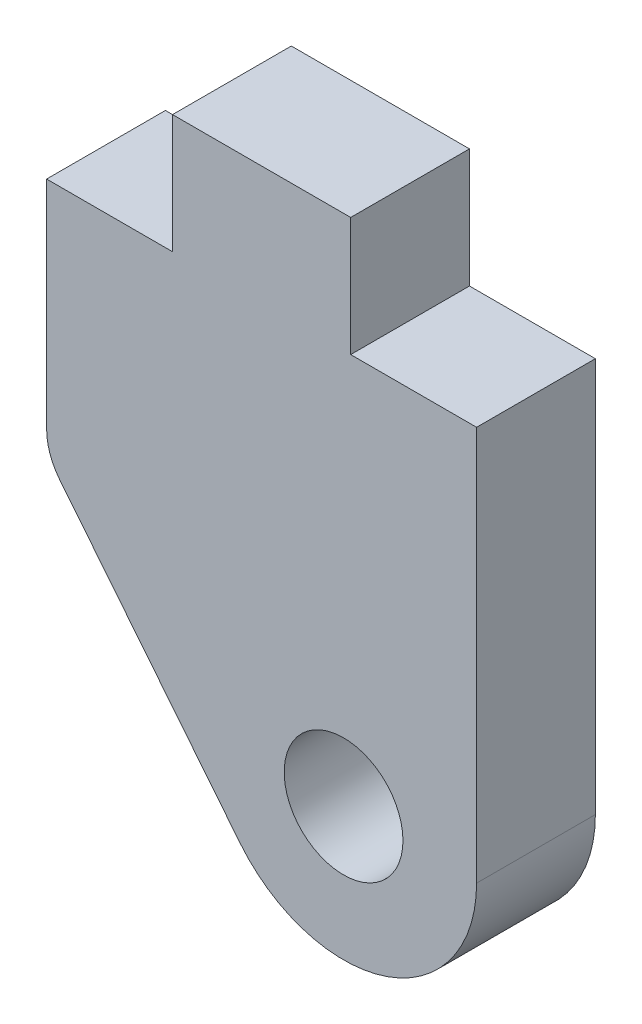
ISO-10303-21;
HEADER;
FILE_DESCRIPTION(('STEP AP214'),'2;1');
FILE_NAME('part.step','',(''),(''),'','','');
FILE_SCHEMA(('AUTOMOTIVE_DESIGN { 1 0 10303 214 1 1 1 1 }'));
ENDSEC;
DATA;
#1=APPLICATION_CONTEXT('core data for automotive mechanical design processes');
#2=APPLICATION_PROTOCOL_DEFINITION('international standard','automotive_design',2000,#1);
#3=PRODUCT_CONTEXT('',#1,'mechanical');
#4=PRODUCT('Part','Part','',(#3));
#5=PRODUCT_RELATED_PRODUCT_CATEGORY('part','',(#4));
#6=PRODUCT_DEFINITION_FORMATION('','',#4);
#7=PRODUCT_DEFINITION_CONTEXT('part definition',#1,'design');
#8=PRODUCT_DEFINITION('design','',#6,#7);
#9=PRODUCT_DEFINITION_SHAPE('','',#8);
#10=(LENGTH_UNIT() NAMED_UNIT(*) SI_UNIT(.MILLI.,.METRE.));
#11=(NAMED_UNIT(*) PLANE_ANGLE_UNIT() SI_UNIT($,.RADIAN.));
#12=(NAMED_UNIT(*) SI_UNIT($,.STERADIAN.) SOLID_ANGLE_UNIT());
#13=UNCERTAINTY_MEASURE_WITH_UNIT(LENGTH_MEASURE(1.E-05),#10,'distance_accuracy_value','');
#14=(GEOMETRIC_REPRESENTATION_CONTEXT(3) GLOBAL_UNCERTAINTY_ASSIGNED_CONTEXT((#13)) GLOBAL_UNIT_ASSIGNED_CONTEXT((#10,
#11,#12)) REPRESENTATION_CONTEXT('',''));
#15=CARTESIAN_POINT('',(0.,0.,0.));
#16=DIRECTION('',(0.,0.,1.));
#17=DIRECTION('',(1.,0.,0.));
#18=AXIS2_PLACEMENT_3D('',#15,#16,#17);
#19=CARTESIAN_POINT('',(-4.15925,-5.79139201383892,1.5875));
#20=DIRECTION('',(0.,0.,-1.));
#21=DIRECTION('',(-1.,0.,0.));
#22=AXIS2_PLACEMENT_3D('',#19,#20,#21);
#23=CYLINDRICAL_SURFACE('',#22,1.5875);
#24=CARTESIAN_POINT('',(-4.15925,-5.79139201383892,-1.5875));
#25=DIRECTION('',(0.,0.,1.));
#26=DIRECTION('',(1.,0.,0.));
#27=AXIS2_PLACEMENT_3D('',#24,#25,#26);
#28=CIRCLE('',#27,1.5875);
#29=CARTESIAN_POINT('',(-5.39693838550955,-6.78551660883431,-1.5875));
#30=VERTEX_POINT('',#29);
#31=CARTESIAN_POINT('',(-5.74675,-5.79139201383891,-1.5875));
#32=VERTEX_POINT('',#31);
#33=EDGE_CURVE('E156',#30,#32,#28,.F.);
#34=ORIENTED_EDGE('',*,*,#33,.F.);
#35=DIRECTION('',(0.,0.,-1.));
#36=VECTOR('',#35,1.);
#37=CARTESIAN_POINT('',(-5.39693838550955,-6.78551660883431,1.5875));
#38=LINE('',#37,#36);
#39=CARTESIAN_POINT('',(-5.39693838550955,-6.78551660883431,1.5875));
#40=VERTEX_POINT('',#39);
#41=EDGE_CURVE('E11',#40,#30,#38,.T.);
#42=ORIENTED_EDGE('',*,*,#41,.F.);
#43=CARTESIAN_POINT('',(-4.15925,-5.79139201383892,1.5875));
#44=DIRECTION('',(0.,0.,1.));
#45=DIRECTION('',(1.,0.,0.));
#46=AXIS2_PLACEMENT_3D('',#43,#44,#45);
#47=CIRCLE('',#46,1.5875);
#48=CARTESIAN_POINT('',(-5.74675,-5.79139201383891,1.5875));
#49=VERTEX_POINT('',#48);
#50=EDGE_CURVE('E196',#40,#49,#47,.F.);
#51=ORIENTED_EDGE('',*,*,#50,.T.);
#52=DIRECTION('',(0.,0.,-1.));
#53=VECTOR('',#52,1.);
#54=CARTESIAN_POINT('',(-5.74675,-5.79139201383891,1.5875));
#55=LINE('',#54,#53);
#56=EDGE_CURVE('E98',#49,#32,#55,.T.);
#57=ORIENTED_EDGE('',*,*,#56,.T.);
#58=EDGE_LOOP('',(#34,#42,#51,#57));
#59=FACE_BOUND('',#58,.T.);
#60=ADVANCED_FACE('F41',(#59),#23,.T.);
#61=CARTESIAN_POINT('',(-6.59341382887821,-5.29590075257269,1.5875));
#62=DIRECTION('',(0.779646227092635,0.626220217319929,0.));
#63=DIRECTION('',(-0.626220217319929,0.779646227092635,0.));
#64=AXIS2_PLACEMENT_3D('',#61,#62,#63);
#65=PLANE('',#64);
#66=DIRECTION('',(0.626220217319929,-0.779646227092635,0.));
#67=VECTOR('',#66,1.);
#68=CARTESIAN_POINT('',(-6.59341382887821,-5.29590075257269,-1.5875));
#69=LINE('',#68,#67);
#70=CARTESIAN_POINT('',(-0.581671983541413,-12.7805390927897,-1.5875));
#71=VERTEX_POINT('',#70);
#72=EDGE_CURVE('E160',#30,#71,#69,.T.);
#73=ORIENTED_EDGE('',*,*,#72,.T.);
#74=DIRECTION('',(0.,0.,-1.));
#75=VECTOR('',#74,1.);
#76=CARTESIAN_POINT('',(-0.581671983541413,-12.7805390927897,1.5875));
#77=LINE('',#76,#75);
#78=CARTESIAN_POINT('',(-0.581671983541413,-12.7805390927897,1.5875));
#79=VERTEX_POINT('',#78);
#80=EDGE_CURVE('E50',#79,#71,#77,.T.);
#81=ORIENTED_EDGE('',*,*,#80,.F.);
#82=DIRECTION('',(0.626220217319929,-0.779646227092635,0.));
#83=VECTOR('',#82,1.);
#84=CARTESIAN_POINT('',(-6.59341382887821,-5.29590075257269,1.5875));
#85=LINE('',#84,#83);
#86=EDGE_CURVE('E238',#40,#79,#85,.T.);
#87=ORIENTED_EDGE('',*,*,#86,.F.);
#88=ORIENTED_EDGE('',*,*,#41,.T.);
#89=EDGE_LOOP('',(#73,#81,#87,#88));
#90=FACE_BOUND('',#89,.T.);
#91=ADVANCED_FACE('F224',(#90),#65,.F.);
#92=CARTESIAN_POINT('',(2.19075,-10.5537,1.5875));
#93=DIRECTION('',(0.,0.,-1.));
#94=DIRECTION('',(-1.,0.,0.));
#95=AXIS2_PLACEMENT_3D('',#92,#93,#94);
#96=CYLINDRICAL_SURFACE('',#95,3.556);
#97=CARTESIAN_POINT('',(2.19075,-10.5537,-1.5875));
#98=DIRECTION('',(0.,0.,1.));
#99=DIRECTION('',(1.,0.,0.));
#100=AXIS2_PLACEMENT_3D('',#97,#98,#99);
#101=CIRCLE('',#100,3.556);
#102=CARTESIAN_POINT('',(5.74675,-10.5537,-1.5875));
#103=VERTEX_POINT('',#102);
#104=EDGE_CURVE('E164',#103,#71,#101,.F.);
#105=ORIENTED_EDGE('',*,*,#104,.F.);
#106=DIRECTION('',(0.,0.,-1.));
#107=VECTOR('',#106,1.);
#108=CARTESIAN_POINT('',(5.74675,-10.5537,1.5875));
#109=LINE('',#108,#107);
#110=CARTESIAN_POINT('',(5.74675,-10.5537,1.5875));
#111=VERTEX_POINT('',#110);
#112=EDGE_CURVE('E212',#111,#103,#109,.T.);
#113=ORIENTED_EDGE('',*,*,#112,.F.);
#114=CARTESIAN_POINT('',(2.19075,-10.5537,1.5875));
#115=DIRECTION('',(0.,0.,1.));
#116=DIRECTION('',(1.,0.,0.));
#117=AXIS2_PLACEMENT_3D('',#114,#115,#116);
#118=CIRCLE('',#117,3.556);
#119=EDGE_CURVE('E221',#111,#79,#118,.F.);
#120=ORIENTED_EDGE('',*,*,#119,.T.);
#121=ORIENTED_EDGE('',*,*,#80,.T.);
#122=EDGE_LOOP('',(#105,#113,#120,#121));
#123=FACE_BOUND('',#122,.T.);
#124=ADVANCED_FACE('F219',(#123),#96,.T.);
#125=CARTESIAN_POINT('',(5.74675,0.,1.5875));
#126=DIRECTION('',(1.,0.,0.));
#127=DIRECTION('',(0.,1.,0.));
#128=AXIS2_PLACEMENT_3D('',#125,#126,#127);
#129=PLANE('',#128);
#130=DIRECTION('',(0.,-1.,0.));
#131=VECTOR('',#130,1.);
#132=CARTESIAN_POINT('',(5.74675,0.,-1.5875));
#133=LINE('',#132,#131);
#134=CARTESIAN_POINT('',(5.74675,0.,-1.5875));
#135=VERTEX_POINT('',#134);
#136=EDGE_CURVE('E168',#135,#103,#133,.T.);
#137=ORIENTED_EDGE('',*,*,#136,.F.);
#138=DIRECTION('',(0.,0.,-1.));
#139=VECTOR('',#138,1.);
#140=CARTESIAN_POINT('',(5.74675,0.,1.5875));
#141=LINE('',#140,#139);
#142=CARTESIAN_POINT('',(5.74675,0.,1.5875));
#143=VERTEX_POINT('',#142);
#144=EDGE_CURVE('E209',#143,#135,#141,.T.);
#145=ORIENTED_EDGE('',*,*,#144,.F.);
#146=DIRECTION('',(0.,-1.,0.));
#147=VECTOR('',#146,1.);
#148=CARTESIAN_POINT('',(5.74675,0.,1.5875));
#149=LINE('',#148,#147);
#150=EDGE_CURVE('E235',#143,#111,#149,.T.);
#151=ORIENTED_EDGE('',*,*,#150,.T.);
#152=ORIENTED_EDGE('',*,*,#112,.T.);
#153=EDGE_LOOP('',(#137,#145,#151,#152));
#154=FACE_BOUND('',#153,.T.);
#155=ADVANCED_FACE('F232',(#154),#129,.T.);
#156=CARTESIAN_POINT('',(0.,0.,1.5875));
#157=DIRECTION('',(0.,1.,0.));
#158=DIRECTION('',(0.,0.,1.));
#159=AXIS2_PLACEMENT_3D('',#156,#157,#158);
#160=PLANE('',#159);
#161=DIRECTION('',(1.,0.,0.));
#162=VECTOR('',#161,1.);
#163=CARTESIAN_POINT('',(0.,0.,-1.5875));
#164=LINE('',#163,#162);
#165=CARTESIAN_POINT('',(2.38125,0.,-1.5875));
#166=VERTEX_POINT('',#165);
#167=EDGE_CURVE('E172',#166,#135,#164,.T.);
#168=ORIENTED_EDGE('',*,*,#167,.F.);
#169=DIRECTION('',(0.,0.,-1.));
#170=VECTOR('',#169,1.);
#171=CARTESIAN_POINT('',(2.38125,0.,1.5875));
#172=LINE('',#171,#170);
#173=CARTESIAN_POINT('',(2.38125,0.,1.5875));
#174=VERTEX_POINT('',#173);
#175=EDGE_CURVE('E206',#174,#166,#172,.T.);
#176=ORIENTED_EDGE('',*,*,#175,.F.);
#177=DIRECTION('',(1.,0.,0.));
#178=VECTOR('',#177,1.);
#179=CARTESIAN_POINT('',(0.,0.,1.5875));
#180=LINE('',#179,#178);
#181=EDGE_CURVE('E243',#174,#143,#180,.T.);
#182=ORIENTED_EDGE('',*,*,#181,.T.);
#183=ORIENTED_EDGE('',*,*,#144,.T.);
#184=EDGE_LOOP('',(#168,#176,#182,#183));
#185=FACE_BOUND('',#184,.T.);
#186=ADVANCED_FACE('F270',(#185),#160,.T.);
#187=CARTESIAN_POINT('',(2.38125,0.,1.5875));
#188=DIRECTION('',(-1.,0.,0.));
#189=DIRECTION('',(0.,0.,1.));
#190=AXIS2_PLACEMENT_3D('',#187,#188,#189);
#191=PLANE('',#190);
#192=DIRECTION('',(0.,1.,0.));
#193=VECTOR('',#192,1.);
#194=CARTESIAN_POINT('',(2.38125,0.,-1.5875));
#195=LINE('',#194,#193);
#196=CARTESIAN_POINT('',(2.38125,3.175,-1.5875));
#197=VERTEX_POINT('',#196);
#198=EDGE_CURVE('E176',#166,#197,#195,.T.);
#199=ORIENTED_EDGE('',*,*,#198,.T.);
#200=DIRECTION('',(0.,0.,-1.));
#201=VECTOR('',#200,1.);
#202=CARTESIAN_POINT('',(2.38125,3.175,1.5875));
#203=LINE('',#202,#201);
#204=CARTESIAN_POINT('',(2.38125,3.175,1.5875));
#205=VERTEX_POINT('',#204);
#206=EDGE_CURVE('E203',#205,#197,#203,.T.);
#207=ORIENTED_EDGE('',*,*,#206,.F.);
#208=DIRECTION('',(0.,1.,0.));
#209=VECTOR('',#208,1.);
#210=CARTESIAN_POINT('',(2.38125,0.,1.5875));
#211=LINE('',#210,#209);
#212=EDGE_CURVE('E250',#174,#205,#211,.T.);
#213=ORIENTED_EDGE('',*,*,#212,.F.);
#214=ORIENTED_EDGE('',*,*,#175,.T.);
#215=EDGE_LOOP('',(#199,#207,#213,#214));
#216=FACE_BOUND('',#215,.T.);
#217=ADVANCED_FACE('F273',(#216),#191,.F.);
#218=CARTESIAN_POINT('',(0.,3.175,1.5875));
#219=DIRECTION('',(0.,1.,0.));
#220=DIRECTION('',(0.,0.,1.));
#221=AXIS2_PLACEMENT_3D('',#218,#219,#220);
#222=PLANE('',#221);
#223=DIRECTION('',(1.,0.,0.));
#224=VECTOR('',#223,1.);
#225=CARTESIAN_POINT('',(0.,3.175,-1.5875));
#226=LINE('',#225,#224);
#227=CARTESIAN_POINT('',(-2.38125,3.175,-1.5875));
#228=VERTEX_POINT('',#227);
#229=EDGE_CURVE('E180',#228,#197,#226,.T.);
#230=ORIENTED_EDGE('',*,*,#229,.F.);
#231=DIRECTION('',(0.,0.,-1.));
#232=VECTOR('',#231,1.);
#233=CARTESIAN_POINT('',(-2.38125,3.175,1.5875));
#234=LINE('',#233,#232);
#235=CARTESIAN_POINT('',(-2.38125,3.175,1.5875));
#236=VERTEX_POINT('',#235);
#237=EDGE_CURVE('E135',#236,#228,#234,.T.);
#238=ORIENTED_EDGE('',*,*,#237,.F.);
#239=DIRECTION('',(1.,0.,0.));
#240=VECTOR('',#239,1.);
#241=CARTESIAN_POINT('',(0.,3.175,1.5875));
#242=LINE('',#241,#240);
#243=EDGE_CURVE('E142',#236,#205,#242,.T.);
#244=ORIENTED_EDGE('',*,*,#243,.T.);
#245=ORIENTED_EDGE('',*,*,#206,.T.);
#246=EDGE_LOOP('',(#230,#238,#244,#245));
#247=FACE_BOUND('',#246,.T.);
#248=ADVANCED_FACE('F255',(#247),#222,.T.);
#249=CARTESIAN_POINT('',(-2.38125,0.,1.5875));
#250=DIRECTION('',(-1.,0.,0.));
#251=DIRECTION('',(0.,0.,1.));
#252=AXIS2_PLACEMENT_3D('',#249,#250,#251);
#253=PLANE('',#252);
#254=DIRECTION('',(0.,1.,0.));
#255=VECTOR('',#254,1.);
#256=CARTESIAN_POINT('',(-2.38125,0.,-1.5875));
#257=LINE('',#256,#255);
#258=CARTESIAN_POINT('',(-2.38125,0.,-1.5875));
#259=VERTEX_POINT('',#258);
#260=EDGE_CURVE('E129',#259,#228,#257,.T.);
#261=ORIENTED_EDGE('',*,*,#260,.F.);
#262=DIRECTION('',(0.,0.,-1.));
#263=VECTOR('',#262,1.);
#264=CARTESIAN_POINT('',(-2.38125,0.,1.5875));
#265=LINE('',#264,#263);
#266=CARTESIAN_POINT('',(-2.38125,0.,1.5875));
#267=VERTEX_POINT('',#266);
#268=EDGE_CURVE('E124',#267,#259,#265,.T.);
#269=ORIENTED_EDGE('',*,*,#268,.F.);
#270=DIRECTION('',(0.,1.,0.));
#271=VECTOR('',#270,1.);
#272=CARTESIAN_POINT('',(-2.38125,0.,1.5875));
#273=LINE('',#272,#271);
#274=EDGE_CURVE('E127',#267,#236,#273,.T.);
#275=ORIENTED_EDGE('',*,*,#274,.T.);
#276=ORIENTED_EDGE('',*,*,#237,.T.);
#277=EDGE_LOOP('',(#261,#269,#275,#276));
#278=FACE_BOUND('',#277,.T.);
#279=ADVANCED_FACE('F126',(#278),#253,.T.);
#280=CARTESIAN_POINT('',(0.,0.,1.5875));
#281=DIRECTION('',(0.,1.,0.));
#282=DIRECTION('',(0.,0.,1.));
#283=AXIS2_PLACEMENT_3D('',#280,#281,#282);
#284=PLANE('',#283);
#285=DIRECTION('',(1.,0.,0.));
#286=VECTOR('',#285,1.);
#287=CARTESIAN_POINT('',(0.,0.,-1.5875));
#288=LINE('',#287,#286);
#289=CARTESIAN_POINT('',(-5.74675,0.,-1.5875));
#290=VERTEX_POINT('',#289);
#291=EDGE_CURVE('E186',#290,#259,#288,.T.);
#292=ORIENTED_EDGE('',*,*,#291,.F.);
#293=DIRECTION('',(0.,0.,-1.));
#294=VECTOR('',#293,1.);
#295=CARTESIAN_POINT('',(-5.74675,0.,1.5875));
#296=LINE('',#295,#294);
#297=CARTESIAN_POINT('',(-5.74675,0.,1.5875));
#298=VERTEX_POINT('',#297);
#299=EDGE_CURVE('E91',#298,#290,#296,.T.);
#300=ORIENTED_EDGE('',*,*,#299,.F.);
#301=DIRECTION('',(1.,0.,0.));
#302=VECTOR('',#301,1.);
#303=CARTESIAN_POINT('',(0.,0.,1.5875));
#304=LINE('',#303,#302);
#305=EDGE_CURVE('E140',#298,#267,#304,.T.);
#306=ORIENTED_EDGE('',*,*,#305,.T.);
#307=ORIENTED_EDGE('',*,*,#268,.T.);
#308=EDGE_LOOP('',(#292,#300,#306,#307));
#309=FACE_BOUND('',#308,.T.);
#310=ADVANCED_FACE('F145',(#309),#284,.T.);
#311=CARTESIAN_POINT('',(-5.74675,0.,1.5875));
#312=DIRECTION('',(1.,0.,0.));
#313=DIRECTION('',(0.,1.,0.));
#314=AXIS2_PLACEMENT_3D('',#311,#312,#313);
#315=PLANE('',#314);
#316=DIRECTION('',(0.,-1.,0.));
#317=VECTOR('',#316,1.);
#318=CARTESIAN_POINT('',(-5.74675,0.,-1.5875));
#319=LINE('',#318,#317);
#320=EDGE_CURVE('E189',#290,#32,#319,.T.);
#321=ORIENTED_EDGE('',*,*,#320,.T.);
#322=ORIENTED_EDGE('',*,*,#56,.F.);
#323=DIRECTION('',(0.,-1.,0.));
#324=VECTOR('',#323,1.);
#325=CARTESIAN_POINT('',(-5.74675,0.,1.5875));
#326=LINE('',#325,#324);
#327=EDGE_CURVE('E58',#298,#49,#326,.T.);
#328=ORIENTED_EDGE('',*,*,#327,.F.);
#329=ORIENTED_EDGE('',*,*,#299,.T.);
#330=EDGE_LOOP('',(#321,#322,#328,#329));
#331=FACE_BOUND('',#330,.T.);
#332=ADVANCED_FACE('F257',(#331),#315,.F.);
#333=CARTESIAN_POINT('',(2.19075,-10.5537,1.5875));
#334=DIRECTION('',(0.,0.,-1.));
#335=DIRECTION('',(-1.,0.,0.));
#336=AXIS2_PLACEMENT_3D('',#333,#334,#335);
#337=CYLINDRICAL_SURFACE('',#336,1.5875);
#338=CARTESIAN_POINT('',(2.19075,-10.5537,1.5875));
#339=DIRECTION('',(0.,0.,1.));
#340=DIRECTION('',(1.,0.,0.));
#341=AXIS2_PLACEMENT_3D('',#338,#339,#340);
#342=CIRCLE('',#341,1.5875);
#343=CARTESIAN_POINT('',(3.77825,-10.5537,1.5875));
#344=VERTEX_POINT('',#343);
#345=EDGE_CURVE('E149',#344,#344,#342,.T.);
#346=ORIENTED_EDGE('',*,*,#345,.T.);
#347=EDGE_LOOP('',(#346));
#348=FACE_BOUND('',#347,.T.);
#349=CARTESIAN_POINT('',(2.19075,-10.5537,-1.5875));
#350=DIRECTION('',(0.,0.,1.));
#351=DIRECTION('',(1.,0.,0.));
#352=AXIS2_PLACEMENT_3D('',#349,#350,#351);
#353=CIRCLE('',#352,1.5875);
#354=CARTESIAN_POINT('',(3.77825,-10.5537,-1.5875));
#355=VERTEX_POINT('',#354);
#356=EDGE_CURVE('E192',#355,#355,#353,.T.);
#357=ORIENTED_EDGE('',*,*,#356,.F.);
#358=EDGE_LOOP('',(#357));
#359=FACE_BOUND('',#358,.T.);
#360=ADVANCED_FACE('F286',(#348,#359),#337,.F.);
#361=CARTESIAN_POINT('',(0.,0.,1.5875));
#362=DIRECTION('',(0.,0.,1.));
#363=DIRECTION('',(1.,0.,0.));
#364=AXIS2_PLACEMENT_3D('',#361,#362,#363);
#365=PLANE('',#364);
#366=ORIENTED_EDGE('',*,*,#50,.F.);
#367=ORIENTED_EDGE('',*,*,#86,.T.);
#368=ORIENTED_EDGE('',*,*,#119,.F.);
#369=ORIENTED_EDGE('',*,*,#150,.F.);
#370=ORIENTED_EDGE('',*,*,#181,.F.);
#371=ORIENTED_EDGE('',*,*,#212,.T.);
#372=ORIENTED_EDGE('',*,*,#243,.F.);
#373=ORIENTED_EDGE('',*,*,#274,.F.);
#374=ORIENTED_EDGE('',*,*,#305,.F.);
#375=ORIENTED_EDGE('',*,*,#327,.T.);
#376=EDGE_LOOP('',(#366,#367,#368,#369,#370,#371,#372,#373,#374,#375));
#377=FACE_BOUND('',#376,.T.);
#378=ORIENTED_EDGE('',*,*,#345,.F.);
#379=EDGE_LOOP('',(#378));
#380=FACE_BOUND('',#379,.T.);
#381=ADVANCED_FACE('F138',(#377,#380),#365,.T.);
#382=CARTESIAN_POINT('',(0.,0.,-1.5875));
#383=DIRECTION('',(0.,0.,1.));
#384=DIRECTION('',(1.,0.,0.));
#385=AXIS2_PLACEMENT_3D('',#382,#383,#384);
#386=PLANE('',#385);
#387=ORIENTED_EDGE('',*,*,#33,.T.);
#388=ORIENTED_EDGE('',*,*,#320,.F.);
#389=ORIENTED_EDGE('',*,*,#291,.T.);
#390=ORIENTED_EDGE('',*,*,#260,.T.);
#391=ORIENTED_EDGE('',*,*,#229,.T.);
#392=ORIENTED_EDGE('',*,*,#198,.F.);
#393=ORIENTED_EDGE('',*,*,#167,.T.);
#394=ORIENTED_EDGE('',*,*,#136,.T.);
#395=ORIENTED_EDGE('',*,*,#104,.T.);
#396=ORIENTED_EDGE('',*,*,#72,.F.);
#397=EDGE_LOOP('',(#387,#388,#389,#390,#391,#392,#393,#394,#395,#396));
#398=FACE_BOUND('',#397,.T.);
#399=ORIENTED_EDGE('',*,*,#356,.T.);
#400=EDGE_LOOP('',(#399));
#401=FACE_BOUND('',#400,.T.);
#402=ADVANCED_FACE('F226',(#398,#401),#386,.F.);
#403=CLOSED_SHELL('',(#60,#91,#124,#155,#186,#217,#248,#279,#310,#332,#360,#381,#402));
#404=MANIFOLD_SOLID_BREP('B2',#403);
#405=ADVANCED_BREP_SHAPE_REPRESENTATION('',(#18,#404),#14);
#406=SHAPE_DEFINITION_REPRESENTATION(#9,#405);
ENDSEC;
END-ISO-10303-21;
